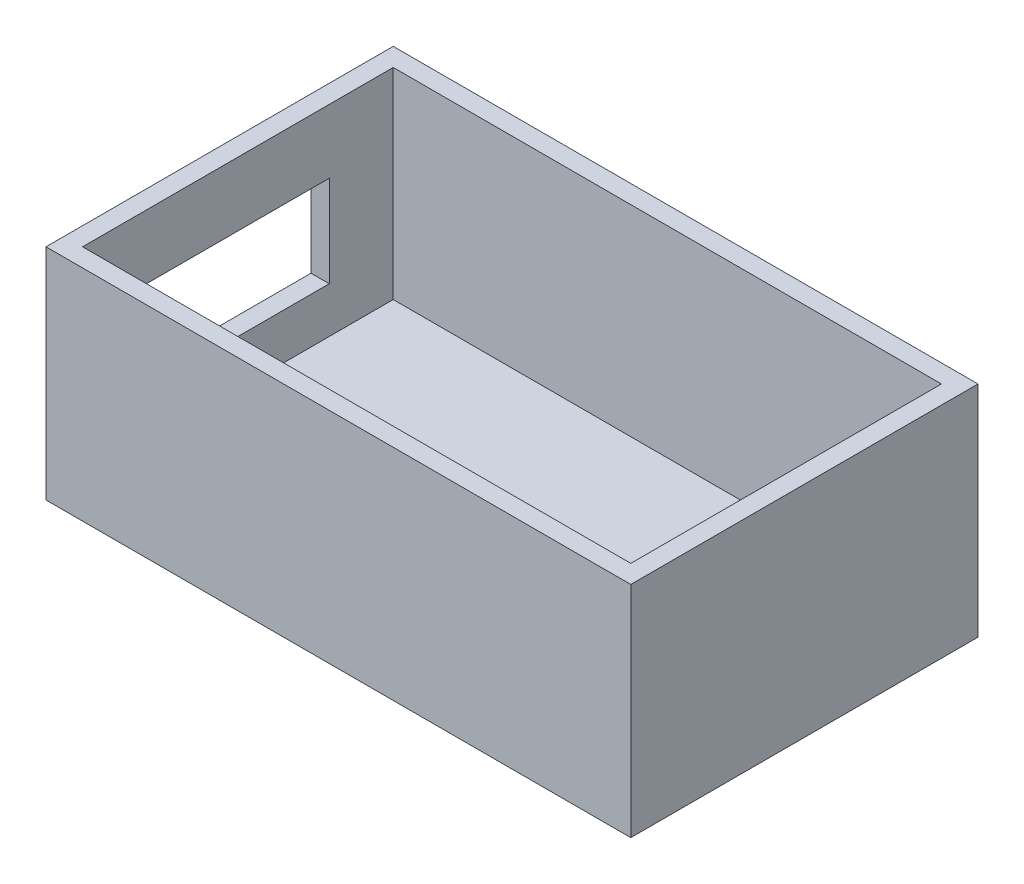
ISO-10303-21;
HEADER;
FILE_DESCRIPTION(('STEP AP214'),'2;1');
FILE_NAME('part.step','',(''),(''),'','','');
FILE_SCHEMA(('AUTOMOTIVE_DESIGN { 1 0 10303 214 1 1 1 1 }'));
ENDSEC;
DATA;
#1=APPLICATION_CONTEXT('core data for automotive mechanical design processes');
#2=APPLICATION_PROTOCOL_DEFINITION('international standard','automotive_design',2000,#1);
#3=PRODUCT_CONTEXT('',#1,'mechanical');
#4=PRODUCT('Part','Part','',(#3));
#5=PRODUCT_RELATED_PRODUCT_CATEGORY('part','',(#4));
#6=PRODUCT_DEFINITION_FORMATION('','',#4);
#7=PRODUCT_DEFINITION_CONTEXT('part definition',#1,'design');
#8=PRODUCT_DEFINITION('design','',#6,#7);
#9=PRODUCT_DEFINITION_SHAPE('','',#8);
#10=(LENGTH_UNIT() NAMED_UNIT(*) SI_UNIT(.MILLI.,.METRE.));
#11=(NAMED_UNIT(*) PLANE_ANGLE_UNIT() SI_UNIT($,.RADIAN.));
#12=(NAMED_UNIT(*) SI_UNIT($,.STERADIAN.) SOLID_ANGLE_UNIT());
#13=UNCERTAINTY_MEASURE_WITH_UNIT(LENGTH_MEASURE(1.E-05),#10,'distance_accuracy_value','');
#14=(GEOMETRIC_REPRESENTATION_CONTEXT(3) GLOBAL_UNCERTAINTY_ASSIGNED_CONTEXT((#13)) GLOBAL_UNIT_ASSIGNED_CONTEXT((#10,
#11,#12)) REPRESENTATION_CONTEXT('',''));
#15=CARTESIAN_POINT('',(0.,0.,0.));
#16=DIRECTION('',(0.,0.,1.));
#17=DIRECTION('',(1.,0.,0.));
#18=AXIS2_PLACEMENT_3D('',#15,#16,#17);
#19=CARTESIAN_POINT('',(-1.,12.,1.));
#20=DIRECTION('',(0.,0.,-1.));
#21=DIRECTION('',(-1.,0.,0.));
#22=AXIS2_PLACEMENT_3D('',#19,#20,#21);
#23=PLANE('',#22);
#24=DIRECTION('',(1.,0.,0.));
#25=VECTOR('',#24,1.);
#26=CARTESIAN_POINT('',(-1.,0.,1.));
#27=LINE('',#26,#25);
#28=CARTESIAN_POINT('',(-1.,0.,1.));
#29=VERTEX_POINT('',#28);
#30=CARTESIAN_POINT('',(31.,0.,1.));
#31=VERTEX_POINT('',#30);
#32=EDGE_CURVE('E235',#29,#31,#27,.T.);
#33=ORIENTED_EDGE('',*,*,#32,.T.);
#34=DIRECTION('',(0.,-1.,0.));
#35=VECTOR('',#34,1.);
#36=CARTESIAN_POINT('',(31.,12.,1.));
#37=LINE('',#36,#35);
#38=CARTESIAN_POINT('',(31.,12.,1.));
#39=VERTEX_POINT('',#38);
#40=EDGE_CURVE('E12',#39,#31,#37,.T.);
#41=ORIENTED_EDGE('',*,*,#40,.F.);
#42=DIRECTION('',(1.,0.,0.));
#43=VECTOR('',#42,1.);
#44=CARTESIAN_POINT('',(-1.,12.,1.));
#45=LINE('',#44,#43);
#46=CARTESIAN_POINT('',(-1.,12.,1.));
#47=VERTEX_POINT('',#46);
#48=EDGE_CURVE('E246',#47,#39,#45,.T.);
#49=ORIENTED_EDGE('',*,*,#48,.F.);
#50=DIRECTION('',(0.,-1.,0.));
#51=VECTOR('',#50,1.);
#52=CARTESIAN_POINT('',(-1.,12.,1.));
#53=LINE('',#52,#51);
#54=EDGE_CURVE('E262',#47,#29,#53,.T.);
#55=ORIENTED_EDGE('',*,*,#54,.T.);
#56=EDGE_LOOP('',(#33,#41,#49,#55));
#57=FACE_BOUND('',#56,.T.);
#58=ADVANCED_FACE('F65',(#57),#23,.F.);
#59=CARTESIAN_POINT('',(31.,12.,1.));
#60=DIRECTION('',(-1.,0.,0.));
#61=DIRECTION('',(0.,0.,1.));
#62=AXIS2_PLACEMENT_3D('',#59,#60,#61);
#63=PLANE('',#62);
#64=DIRECTION('',(0.,0.,-1.));
#65=VECTOR('',#64,1.);
#66=CARTESIAN_POINT('',(31.,0.,1.));
#67=LINE('',#66,#65);
#68=CARTESIAN_POINT('',(31.,0.,-18.));
#69=VERTEX_POINT('',#68);
#70=EDGE_CURVE('E266',#31,#69,#67,.T.);
#71=ORIENTED_EDGE('',*,*,#70,.T.);
#72=DIRECTION('',(0.,-1.,0.));
#73=VECTOR('',#72,1.);
#74=CARTESIAN_POINT('',(31.,12.,-18.));
#75=LINE('',#74,#73);
#76=CARTESIAN_POINT('',(31.,12.,-18.));
#77=VERTEX_POINT('',#76);
#78=EDGE_CURVE('E73',#77,#69,#75,.T.);
#79=ORIENTED_EDGE('',*,*,#78,.F.);
#80=DIRECTION('',(0.,0.,-1.));
#81=VECTOR('',#80,1.);
#82=CARTESIAN_POINT('',(31.,12.,1.));
#83=LINE('',#82,#81);
#84=EDGE_CURVE('E250',#39,#77,#83,.T.);
#85=ORIENTED_EDGE('',*,*,#84,.F.);
#86=ORIENTED_EDGE('',*,*,#40,.T.);
#87=EDGE_LOOP('',(#71,#79,#85,#86));
#88=FACE_BOUND('',#87,.T.);
#89=ADVANCED_FACE('F288',(#88),#63,.F.);
#90=CARTESIAN_POINT('',(-1.,12.,-18.));
#91=DIRECTION('',(0.,0.,-1.));
#92=DIRECTION('',(-1.,0.,0.));
#93=AXIS2_PLACEMENT_3D('',#90,#91,#92);
#94=PLANE('',#93);
#95=DIRECTION('',(1.,0.,0.));
#96=VECTOR('',#95,1.);
#97=CARTESIAN_POINT('',(-1.,0.,-18.));
#98=LINE('',#97,#96);
#99=CARTESIAN_POINT('',(-1.,0.,-18.));
#100=VERTEX_POINT('',#99);
#101=EDGE_CURVE('E270',#100,#69,#98,.T.);
#102=ORIENTED_EDGE('',*,*,#101,.F.);
#103=DIRECTION('',(0.,-1.,0.));
#104=VECTOR('',#103,1.);
#105=CARTESIAN_POINT('',(-1.,12.,-18.));
#106=LINE('',#105,#104);
#107=CARTESIAN_POINT('',(-1.,12.,-18.));
#108=VERTEX_POINT('',#107);
#109=EDGE_CURVE('E279',#108,#100,#106,.T.);
#110=ORIENTED_EDGE('',*,*,#109,.F.);
#111=DIRECTION('',(1.,0.,0.));
#112=VECTOR('',#111,1.);
#113=CARTESIAN_POINT('',(-1.,12.,-18.));
#114=LINE('',#113,#112);
#115=EDGE_CURVE('E254',#108,#77,#114,.T.);
#116=ORIENTED_EDGE('',*,*,#115,.T.);
#117=ORIENTED_EDGE('',*,*,#78,.T.);
#118=EDGE_LOOP('',(#102,#110,#116,#117));
#119=FACE_BOUND('',#118,.T.);
#120=ADVANCED_FACE('F285',(#119),#94,.T.);
#121=CARTESIAN_POINT('',(-1.,12.,1.));
#122=DIRECTION('',(-1.,0.,0.));
#123=DIRECTION('',(0.,0.,1.));
#124=AXIS2_PLACEMENT_3D('',#121,#122,#123);
#125=PLANE('',#124);
#126=DIRECTION('',(0.,-1.,0.));
#127=VECTOR('',#126,1.);
#128=CARTESIAN_POINT('',(-1.,0.,-13.5));
#129=LINE('',#128,#127);
#130=CARTESIAN_POINT('',(-1.,8.5,-13.5));
#131=VERTEX_POINT('',#130);
#132=CARTESIAN_POINT('',(-1.,3.5,-13.5));
#133=VERTEX_POINT('',#132);
#134=EDGE_CURVE('E80',#131,#133,#129,.T.);
#135=ORIENTED_EDGE('',*,*,#134,.F.);
#136=DIRECTION('',(0.,0.,1.));
#137=VECTOR('',#136,1.);
#138=CARTESIAN_POINT('',(-1.,8.5,0.));
#139=LINE('',#138,#137);
#140=CARTESIAN_POINT('',(-1.,8.5,-3.5));
#141=VERTEX_POINT('',#140);
#142=EDGE_CURVE('E173',#131,#141,#139,.T.);
#143=ORIENTED_EDGE('',*,*,#142,.T.);
#144=DIRECTION('',(0.,-1.,0.));
#145=VECTOR('',#144,1.);
#146=CARTESIAN_POINT('',(-1.,0.,-3.5));
#147=LINE('',#146,#145);
#148=CARTESIAN_POINT('',(-1.,3.5,-3.5));
#149=VERTEX_POINT('',#148);
#150=EDGE_CURVE('E177',#141,#149,#147,.T.);
#151=ORIENTED_EDGE('',*,*,#150,.T.);
#152=DIRECTION('',(0.,0.,1.));
#153=VECTOR('',#152,1.);
#154=CARTESIAN_POINT('',(-1.,3.5,0.));
#155=LINE('',#154,#153);
#156=EDGE_CURVE('E186',#133,#149,#155,.T.);
#157=ORIENTED_EDGE('',*,*,#156,.F.);
#158=EDGE_LOOP('',(#135,#143,#151,#157));
#159=FACE_BOUND('',#158,.T.);
#160=DIRECTION('',(0.,0.,-1.));
#161=VECTOR('',#160,1.);
#162=CARTESIAN_POINT('',(-1.,0.,1.));
#163=LINE('',#162,#161);
#164=EDGE_CURVE('E251',#29,#100,#163,.T.);
#165=ORIENTED_EDGE('',*,*,#164,.F.);
#166=ORIENTED_EDGE('',*,*,#54,.F.);
#167=DIRECTION('',(0.,0.,-1.));
#168=VECTOR('',#167,1.);
#169=CARTESIAN_POINT('',(-1.,12.,1.));
#170=LINE('',#169,#168);
#171=EDGE_CURVE('E258',#47,#108,#170,.T.);
#172=ORIENTED_EDGE('',*,*,#171,.T.);
#173=ORIENTED_EDGE('',*,*,#109,.T.);
#174=EDGE_LOOP('',(#165,#166,#172,#173));
#175=FACE_BOUND('',#174,.T.);
#176=ADVANCED_FACE('F295',(#159,#175),#125,.T.);
#177=CARTESIAN_POINT('',(0.,12.,0.));
#178=DIRECTION('',(0.,1.,0.));
#179=DIRECTION('',(0.,0.,1.));
#180=AXIS2_PLACEMENT_3D('',#177,#178,#179);
#181=PLANE('',#180);
#182=DIRECTION('',(1.,0.,0.));
#183=VECTOR('',#182,1.);
#184=CARTESIAN_POINT('',(0.,12.,-17.));
#185=LINE('',#184,#183);
#186=CARTESIAN_POINT('',(0.,12.,-17.));
#187=VERTEX_POINT('',#186);
#188=CARTESIAN_POINT('',(30.,12.,-17.));
#189=VERTEX_POINT('',#188);
#190=EDGE_CURVE('E215',#187,#189,#185,.T.);
#191=ORIENTED_EDGE('',*,*,#190,.T.);
#192=DIRECTION('',(0.,0.,-1.));
#193=VECTOR('',#192,1.);
#194=CARTESIAN_POINT('',(30.,12.,0.));
#195=LINE('',#194,#193);
#196=CARTESIAN_POINT('',(30.,12.,0.));
#197=VERTEX_POINT('',#196);
#198=EDGE_CURVE('E219',#197,#189,#195,.T.);
#199=ORIENTED_EDGE('',*,*,#198,.F.);
#200=DIRECTION('',(1.,0.,0.));
#201=VECTOR('',#200,1.);
#202=CARTESIAN_POINT('',(0.,12.,0.));
#203=LINE('',#202,#201);
#204=CARTESIAN_POINT('',(0.,12.,0.));
#205=VERTEX_POINT('',#204);
#206=EDGE_CURVE('E222',#205,#197,#203,.T.);
#207=ORIENTED_EDGE('',*,*,#206,.F.);
#208=DIRECTION('',(0.,0.,-1.));
#209=VECTOR('',#208,1.);
#210=CARTESIAN_POINT('',(0.,12.,0.));
#211=LINE('',#210,#209);
#212=EDGE_CURVE('E226',#205,#187,#211,.T.);
#213=ORIENTED_EDGE('',*,*,#212,.T.);
#214=EDGE_LOOP('',(#191,#199,#207,#213));
#215=FACE_BOUND('',#214,.T.);
#216=ORIENTED_EDGE('',*,*,#48,.T.);
#217=ORIENTED_EDGE('',*,*,#84,.T.);
#218=ORIENTED_EDGE('',*,*,#115,.F.);
#219=ORIENTED_EDGE('',*,*,#171,.F.);
#220=EDGE_LOOP('',(#216,#217,#218,#219));
#221=FACE_BOUND('',#220,.T.);
#222=ADVANCED_FACE('F299',(#215,#221),#181,.T.);
#223=CARTESIAN_POINT('',(0.,0.,0.));
#224=DIRECTION('',(0.,1.,0.));
#225=DIRECTION('',(0.,0.,1.));
#226=AXIS2_PLACEMENT_3D('',#223,#224,#225);
#227=PLANE('',#226);
#228=ORIENTED_EDGE('',*,*,#32,.F.);
#229=ORIENTED_EDGE('',*,*,#164,.T.);
#230=ORIENTED_EDGE('',*,*,#101,.T.);
#231=ORIENTED_EDGE('',*,*,#70,.F.);
#232=EDGE_LOOP('',(#228,#229,#230,#231));
#233=FACE_BOUND('',#232,.T.);
#234=ADVANCED_FACE('F292',(#233),#227,.F.);
#235=CARTESIAN_POINT('',(0.,12.,-17.));
#236=DIRECTION('',(0.,0.,-1.));
#237=DIRECTION('',(-1.,0.,0.));
#238=AXIS2_PLACEMENT_3D('',#235,#236,#237);
#239=PLANE('',#238);
#240=DIRECTION('',(0.,-1.,0.));
#241=VECTOR('',#240,1.);
#242=CARTESIAN_POINT('',(0.,12.,-17.));
#243=LINE('',#242,#241);
#244=CARTESIAN_POINT('',(0.,1.,-17.));
#245=VERTEX_POINT('',#244);
#246=EDGE_CURVE('E231',#187,#245,#243,.T.);
#247=ORIENTED_EDGE('',*,*,#246,.T.);
#248=DIRECTION('',(1.,0.,0.));
#249=VECTOR('',#248,1.);
#250=CARTESIAN_POINT('',(0.,1.,-17.));
#251=LINE('',#250,#249);
#252=CARTESIAN_POINT('',(30.,1.,-17.));
#253=VERTEX_POINT('',#252);
#254=EDGE_CURVE('E208',#245,#253,#251,.T.);
#255=ORIENTED_EDGE('',*,*,#254,.T.);
#256=DIRECTION('',(0.,-1.,0.));
#257=VECTOR('',#256,1.);
#258=CARTESIAN_POINT('',(30.,12.,-17.));
#259=LINE('',#258,#257);
#260=EDGE_CURVE('E230',#189,#253,#259,.T.);
#261=ORIENTED_EDGE('',*,*,#260,.F.);
#262=ORIENTED_EDGE('',*,*,#190,.F.);
#263=EDGE_LOOP('',(#247,#255,#261,#262));
#264=FACE_BOUND('',#263,.T.);
#265=ADVANCED_FACE('F315',(#264),#239,.F.);
#266=CARTESIAN_POINT('',(0.,12.,0.));
#267=DIRECTION('',(-1.,0.,0.));
#268=DIRECTION('',(0.,0.,1.));
#269=AXIS2_PLACEMENT_3D('',#266,#267,#268);
#270=PLANE('',#269);
#271=DIRECTION('',(0.,0.,1.));
#272=VECTOR('',#271,1.);
#273=CARTESIAN_POINT('',(0.,8.5,0.));
#274=LINE('',#273,#272);
#275=CARTESIAN_POINT('',(0.,8.5,-13.5));
#276=VERTEX_POINT('',#275);
#277=CARTESIAN_POINT('',(0.,8.5,-3.5));
#278=VERTEX_POINT('',#277);
#279=EDGE_CURVE('E160',#276,#278,#274,.T.);
#280=ORIENTED_EDGE('',*,*,#279,.F.);
#281=DIRECTION('',(0.,-1.,0.));
#282=VECTOR('',#281,1.);
#283=CARTESIAN_POINT('',(0.,0.,-13.5));
#284=LINE('',#283,#282);
#285=CARTESIAN_POINT('',(0.,3.5,-13.5));
#286=VERTEX_POINT('',#285);
#287=EDGE_CURVE('E156',#276,#286,#284,.T.);
#288=ORIENTED_EDGE('',*,*,#287,.T.);
#289=DIRECTION('',(0.,0.,1.));
#290=VECTOR('',#289,1.);
#291=CARTESIAN_POINT('',(0.,3.5,0.));
#292=LINE('',#291,#290);
#293=CARTESIAN_POINT('',(0.,3.5,-3.5));
#294=VERTEX_POINT('',#293);
#295=EDGE_CURVE('E163',#286,#294,#292,.T.);
#296=ORIENTED_EDGE('',*,*,#295,.T.);
#297=DIRECTION('',(0.,-1.,0.));
#298=VECTOR('',#297,1.);
#299=CARTESIAN_POINT('',(0.,0.,-3.5));
#300=LINE('',#299,#298);
#301=EDGE_CURVE('E168',#278,#294,#300,.T.);
#302=ORIENTED_EDGE('',*,*,#301,.F.);
#303=EDGE_LOOP('',(#280,#288,#296,#302));
#304=FACE_BOUND('',#303,.T.);
#305=DIRECTION('',(0.,-1.,0.));
#306=VECTOR('',#305,1.);
#307=CARTESIAN_POINT('',(0.,12.,0.));
#308=LINE('',#307,#306);
#309=CARTESIAN_POINT('',(0.,1.,0.));
#310=VERTEX_POINT('',#309);
#311=EDGE_CURVE('E236',#205,#310,#308,.T.);
#312=ORIENTED_EDGE('',*,*,#311,.T.);
#313=DIRECTION('',(0.,0.,-1.));
#314=VECTOR('',#313,1.);
#315=CARTESIAN_POINT('',(0.,1.,0.));
#316=LINE('',#315,#314);
#317=EDGE_CURVE('E212',#310,#245,#316,.T.);
#318=ORIENTED_EDGE('',*,*,#317,.T.);
#319=ORIENTED_EDGE('',*,*,#246,.F.);
#320=ORIENTED_EDGE('',*,*,#212,.F.);
#321=EDGE_LOOP('',(#312,#318,#319,#320));
#322=FACE_BOUND('',#321,.T.);
#323=ADVANCED_FACE('F170',(#304,#322),#270,.F.);
#324=CARTESIAN_POINT('',(0.,12.,0.));
#325=DIRECTION('',(0.,0.,-1.));
#326=DIRECTION('',(-1.,0.,0.));
#327=AXIS2_PLACEMENT_3D('',#324,#325,#326);
#328=PLANE('',#327);
#329=DIRECTION('',(1.,0.,0.));
#330=VECTOR('',#329,1.);
#331=CARTESIAN_POINT('',(0.,1.,0.));
#332=LINE('',#331,#330);
#333=CARTESIAN_POINT('',(30.,1.,0.));
#334=VERTEX_POINT('',#333);
#335=EDGE_CURVE('E195',#310,#334,#332,.T.);
#336=ORIENTED_EDGE('',*,*,#335,.F.);
#337=ORIENTED_EDGE('',*,*,#311,.F.);
#338=ORIENTED_EDGE('',*,*,#206,.T.);
#339=DIRECTION('',(0.,-1.,0.));
#340=VECTOR('',#339,1.);
#341=CARTESIAN_POINT('',(30.,12.,0.));
#342=LINE('',#341,#340);
#343=EDGE_CURVE('E240',#197,#334,#342,.T.);
#344=ORIENTED_EDGE('',*,*,#343,.T.);
#345=EDGE_LOOP('',(#336,#337,#338,#344));
#346=FACE_BOUND('',#345,.T.);
#347=ADVANCED_FACE('F326',(#346),#328,.T.);
#348=CARTESIAN_POINT('',(30.,12.,0.));
#349=DIRECTION('',(-1.,0.,0.));
#350=DIRECTION('',(0.,0.,1.));
#351=AXIS2_PLACEMENT_3D('',#348,#349,#350);
#352=PLANE('',#351);
#353=DIRECTION('',(0.,0.,-1.));
#354=VECTOR('',#353,1.);
#355=CARTESIAN_POINT('',(30.,1.,0.));
#356=LINE('',#355,#354);
#357=EDGE_CURVE('E204',#334,#253,#356,.T.);
#358=ORIENTED_EDGE('',*,*,#357,.F.);
#359=ORIENTED_EDGE('',*,*,#343,.F.);
#360=ORIENTED_EDGE('',*,*,#198,.T.);
#361=ORIENTED_EDGE('',*,*,#260,.T.);
#362=EDGE_LOOP('',(#358,#359,#360,#361));
#363=FACE_BOUND('',#362,.T.);
#364=ADVANCED_FACE('F322',(#363),#352,.T.);
#365=CARTESIAN_POINT('',(0.,1.,0.));
#366=DIRECTION('',(0.,1.,0.));
#367=DIRECTION('',(0.,0.,1.));
#368=AXIS2_PLACEMENT_3D('',#365,#366,#367);
#369=PLANE('',#368);
#370=ORIENTED_EDGE('',*,*,#335,.T.);
#371=ORIENTED_EDGE('',*,*,#357,.T.);
#372=ORIENTED_EDGE('',*,*,#254,.F.);
#373=ORIENTED_EDGE('',*,*,#317,.F.);
#374=EDGE_LOOP('',(#370,#371,#372,#373));
#375=FACE_BOUND('',#374,.T.);
#376=ADVANCED_FACE('F325',(#375),#369,.T.);
#377=CARTESIAN_POINT('',(0.,0.,-13.5));
#378=DIRECTION('',(0.,0.,-1.));
#379=DIRECTION('',(-1.,0.,0.));
#380=AXIS2_PLACEMENT_3D('',#377,#378,#379);
#381=PLANE('',#380);
#382=ORIENTED_EDGE('',*,*,#134,.T.);
#383=DIRECTION('',(-1.,0.,0.));
#384=VECTOR('',#383,1.);
#385=CARTESIAN_POINT('',(0.,3.5,-13.5));
#386=LINE('',#385,#384);
#387=EDGE_CURVE('E153',#286,#133,#386,.T.);
#388=ORIENTED_EDGE('',*,*,#387,.F.);
#389=ORIENTED_EDGE('',*,*,#287,.F.);
#390=DIRECTION('',(-1.,0.,0.));
#391=VECTOR('',#390,1.);
#392=CARTESIAN_POINT('',(0.,8.5,-13.5));
#393=LINE('',#392,#391);
#394=EDGE_CURVE('E192',#276,#131,#393,.T.);
#395=ORIENTED_EDGE('',*,*,#394,.T.);
#396=EDGE_LOOP('',(#382,#388,#389,#395));
#397=FACE_BOUND('',#396,.T.);
#398=ADVANCED_FACE('F154',(#397),#381,.F.);
#399=CARTESIAN_POINT('',(0.,8.5,0.));
#400=DIRECTION('',(0.,-1.,0.));
#401=DIRECTION('',(0.,0.,-1.));
#402=AXIS2_PLACEMENT_3D('',#399,#400,#401);
#403=PLANE('',#402);
#404=ORIENTED_EDGE('',*,*,#142,.F.);
#405=ORIENTED_EDGE('',*,*,#394,.F.);
#406=ORIENTED_EDGE('',*,*,#279,.T.);
#407=DIRECTION('',(-1.,0.,0.));
#408=VECTOR('',#407,1.);
#409=CARTESIAN_POINT('',(0.,8.5,-3.5));
#410=LINE('',#409,#408);
#411=EDGE_CURVE('E196',#278,#141,#410,.T.);
#412=ORIENTED_EDGE('',*,*,#411,.T.);
#413=EDGE_LOOP('',(#404,#405,#406,#412));
#414=FACE_BOUND('',#413,.T.);
#415=ADVANCED_FACE('F338',(#414),#403,.T.);
#416=CARTESIAN_POINT('',(0.,0.,-3.5));
#417=DIRECTION('',(0.,0.,-1.));
#418=DIRECTION('',(-1.,0.,0.));
#419=AXIS2_PLACEMENT_3D('',#416,#417,#418);
#420=PLANE('',#419);
#421=ORIENTED_EDGE('',*,*,#150,.F.);
#422=ORIENTED_EDGE('',*,*,#411,.F.);
#423=ORIENTED_EDGE('',*,*,#301,.T.);
#424=DIRECTION('',(-1.,0.,0.));
#425=VECTOR('',#424,1.);
#426=CARTESIAN_POINT('',(0.,3.5,-3.5));
#427=LINE('',#426,#425);
#428=EDGE_CURVE('E88',#294,#149,#427,.T.);
#429=ORIENTED_EDGE('',*,*,#428,.T.);
#430=EDGE_LOOP('',(#421,#422,#423,#429));
#431=FACE_BOUND('',#430,.T.);
#432=ADVANCED_FACE('F341',(#431),#420,.T.);
#433=CARTESIAN_POINT('',(0.,3.5,0.));
#434=DIRECTION('',(0.,-1.,0.));
#435=DIRECTION('',(0.,0.,-1.));
#436=AXIS2_PLACEMENT_3D('',#433,#434,#435);
#437=PLANE('',#436);
#438=ORIENTED_EDGE('',*,*,#156,.T.);
#439=ORIENTED_EDGE('',*,*,#428,.F.);
#440=ORIENTED_EDGE('',*,*,#295,.F.);
#441=ORIENTED_EDGE('',*,*,#387,.T.);
#442=EDGE_LOOP('',(#438,#439,#440,#441));
#443=FACE_BOUND('',#442,.T.);
#444=ADVANCED_FACE('F164',(#443),#437,.F.);
#445=CLOSED_SHELL('',(#58,#89,#120,#176,#222,#234,#265,#323,#347,#364,#376,#398,#415,#432,#444));
#446=MANIFOLD_SOLID_BREP('B2',#445);
#447=ADVANCED_BREP_SHAPE_REPRESENTATION('',(#18,#446),#14);
#448=SHAPE_DEFINITION_REPRESENTATION(#9,#447);
ENDSEC;
END-ISO-10303-21;
